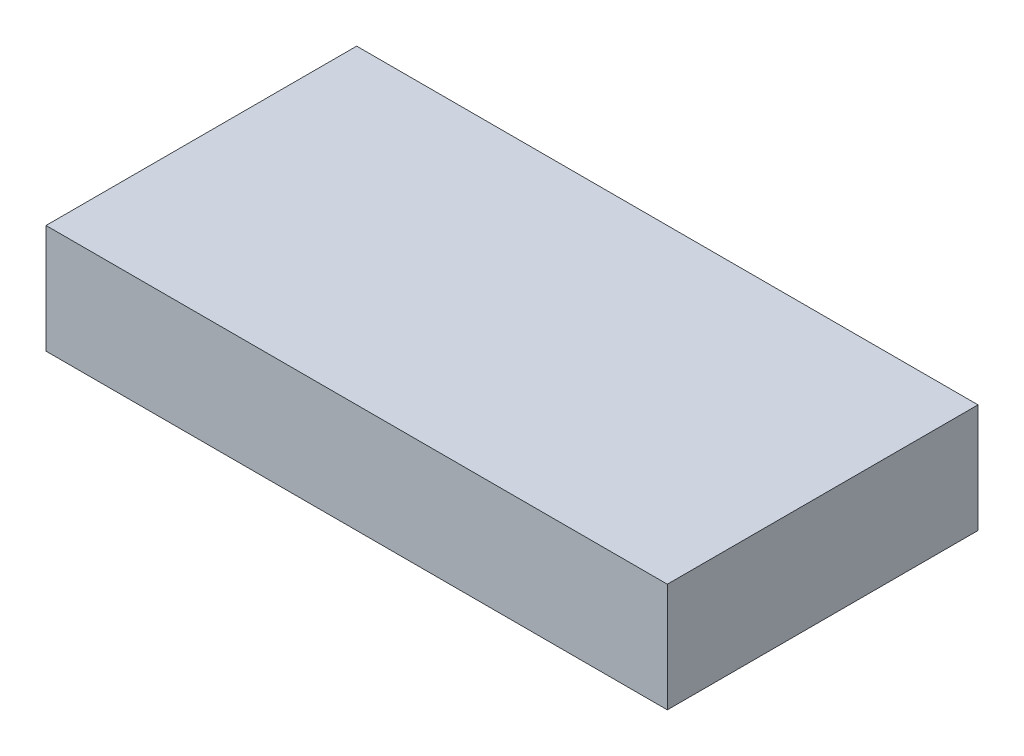
ISO-10303-21;
HEADER;
FILE_DESCRIPTION(('STEP AP214'),'2;1');
FILE_NAME('part.step','',(''),(''),'','','');
FILE_SCHEMA(('AUTOMOTIVE_DESIGN { 1 0 10303 214 1 1 1 1 }'));
ENDSEC;
DATA;
#1=APPLICATION_CONTEXT('core data for automotive mechanical design processes');
#2=APPLICATION_PROTOCOL_DEFINITION('international standard','automotive_design',2000,#1);
#3=PRODUCT_CONTEXT('',#1,'mechanical');
#4=PRODUCT('Part','Part','',(#3));
#5=PRODUCT_RELATED_PRODUCT_CATEGORY('part','',(#4));
#6=PRODUCT_DEFINITION_FORMATION('','',#4);
#7=PRODUCT_DEFINITION_CONTEXT('part definition',#1,'design');
#8=PRODUCT_DEFINITION('design','',#6,#7);
#9=PRODUCT_DEFINITION_SHAPE('','',#8);
#10=(LENGTH_UNIT() NAMED_UNIT(*) SI_UNIT(.MILLI.,.METRE.));
#11=(NAMED_UNIT(*) PLANE_ANGLE_UNIT() SI_UNIT($,.RADIAN.));
#12=(NAMED_UNIT(*) SI_UNIT($,.STERADIAN.) SOLID_ANGLE_UNIT());
#13=UNCERTAINTY_MEASURE_WITH_UNIT(LENGTH_MEASURE(1.E-05),#10,'distance_accuracy_value','');
#14=(GEOMETRIC_REPRESENTATION_CONTEXT(3) GLOBAL_UNCERTAINTY_ASSIGNED_CONTEXT((#13)) GLOBAL_UNIT_ASSIGNED_CONTEXT((#10,
#11,#12)) REPRESENTATION_CONTEXT('',''));
#15=CARTESIAN_POINT('',(0.,0.,0.));
#16=DIRECTION('',(0.,0.,1.));
#17=DIRECTION('',(1.,0.,0.));
#18=AXIS2_PLACEMENT_3D('',#15,#16,#17);
#19=CARTESIAN_POINT('',(0.,1.6425,0.));
#20=DIRECTION('',(0.,1.,0.));
#21=DIRECTION('',(0.,0.,1.));
#22=AXIS2_PLACEMENT_3D('',#19,#20,#21);
#23=PLANE('',#22);
#24=DIRECTION('',(0.,0.,-1.));
#25=VECTOR('',#24,1.);
#26=CARTESIAN_POINT('',(6.4225,1.6425,2.39));
#27=LINE('',#26,#25);
#28=CARTESIAN_POINT('',(6.4225,1.6425,-2.39));
#29=VERTEX_POINT('',#28);
#30=CARTESIAN_POINT('',(6.4225,1.6425,2.39));
#31=VERTEX_POINT('',#30);
#32=EDGE_CURVE('E122',#29,#31,#27,.F.);
#33=ORIENTED_EDGE('',*,*,#32,.T.);
#34=DIRECTION('',(1.,0.,0.));
#35=VECTOR('',#34,1.);
#36=CARTESIAN_POINT('',(-6.4225,1.6425,2.39));
#37=LINE('',#36,#35);
#38=CARTESIAN_POINT('',(-6.4225,1.6425,2.39));
#39=VERTEX_POINT('',#38);
#40=EDGE_CURVE('E107',#31,#39,#37,.F.);
#41=ORIENTED_EDGE('',*,*,#40,.T.);
#42=DIRECTION('',(0.,0.,1.));
#43=VECTOR('',#42,1.);
#44=CARTESIAN_POINT('',(-6.4225,1.6425,-2.39));
#45=LINE('',#44,#43);
#46=CARTESIAN_POINT('',(-6.4225,1.6425,-2.39));
#47=VERTEX_POINT('',#46);
#48=EDGE_CURVE('E19',#39,#47,#45,.F.);
#49=ORIENTED_EDGE('',*,*,#48,.T.);
#50=DIRECTION('',(-1.,0.,0.));
#51=VECTOR('',#50,1.);
#52=CARTESIAN_POINT('',(6.4225,1.6425,-2.39));
#53=LINE('',#52,#51);
#54=EDGE_CURVE('E102',#47,#29,#53,.F.);
#55=ORIENTED_EDGE('',*,*,#54,.T.);
#56=EDGE_LOOP('',(#33,#41,#49,#55));
#57=FACE_BOUND('',#56,.T.);
#58=ADVANCED_FACE('F16',(#57),#23,.F.);
#59=CARTESIAN_POINT('',(-6.4225,0.,-2.39));
#60=DIRECTION('',(-1.,0.,0.));
#61=DIRECTION('',(0.,0.,1.));
#62=AXIS2_PLACEMENT_3D('',#59,#60,#61);
#63=PLANE('',#62);
#64=ORIENTED_EDGE('',*,*,#48,.F.);
#65=DIRECTION('',(0.,1.,0.));
#66=VECTOR('',#65,1.);
#67=CARTESIAN_POINT('',(-6.4225,0.,2.39));
#68=LINE('',#67,#66);
#69=CARTESIAN_POINT('',(-6.4225,0.,2.39));
#70=VERTEX_POINT('',#69);
#71=EDGE_CURVE('E130',#39,#70,#68,.F.);
#72=ORIENTED_EDGE('',*,*,#71,.T.);
#73=DIRECTION('',(0.,0.,1.));
#74=VECTOR('',#73,1.);
#75=CARTESIAN_POINT('',(-6.4225,0.,0.));
#76=LINE('',#75,#74);
#77=CARTESIAN_POINT('',(-6.4225,0.,-2.39));
#78=VERTEX_POINT('',#77);
#79=EDGE_CURVE('E114',#70,#78,#76,.F.);
#80=ORIENTED_EDGE('',*,*,#79,.T.);
#81=DIRECTION('',(0.,1.,0.));
#82=VECTOR('',#81,1.);
#83=CARTESIAN_POINT('',(-6.4225,0.,-2.39));
#84=LINE('',#83,#82);
#85=EDGE_CURVE('E110',#78,#47,#84,.T.);
#86=ORIENTED_EDGE('',*,*,#85,.T.);
#87=EDGE_LOOP('',(#64,#72,#80,#86));
#88=FACE_BOUND('',#87,.T.);
#89=ADVANCED_FACE('F112',(#88),#63,.F.);
#90=CARTESIAN_POINT('',(6.4225,0.,-2.39));
#91=DIRECTION('',(0.,0.,-1.));
#92=DIRECTION('',(-1.,0.,0.));
#93=AXIS2_PLACEMENT_3D('',#90,#91,#92);
#94=PLANE('',#93);
#95=ORIENTED_EDGE('',*,*,#54,.F.);
#96=ORIENTED_EDGE('',*,*,#85,.F.);
#97=DIRECTION('',(1.,0.,0.));
#98=VECTOR('',#97,1.);
#99=CARTESIAN_POINT('',(0.,0.,-2.39));
#100=LINE('',#99,#98);
#101=CARTESIAN_POINT('',(6.4225,0.,-2.39));
#102=VERTEX_POINT('',#101);
#103=EDGE_CURVE('E133',#78,#102,#100,.T.);
#104=ORIENTED_EDGE('',*,*,#103,.T.);
#105=DIRECTION('',(0.,1.,0.));
#106=VECTOR('',#105,1.);
#107=CARTESIAN_POINT('',(6.4225,0.,-2.39));
#108=LINE('',#107,#106);
#109=EDGE_CURVE('E119',#102,#29,#108,.T.);
#110=ORIENTED_EDGE('',*,*,#109,.T.);
#111=EDGE_LOOP('',(#95,#96,#104,#110));
#112=FACE_BOUND('',#111,.T.);
#113=ADVANCED_FACE('F117',(#112),#94,.F.);
#114=CARTESIAN_POINT('',(6.4225,0.,2.39));
#115=DIRECTION('',(1.,0.,0.));
#116=DIRECTION('',(0.,0.,-1.));
#117=AXIS2_PLACEMENT_3D('',#114,#115,#116);
#118=PLANE('',#117);
#119=ORIENTED_EDGE('',*,*,#32,.F.);
#120=ORIENTED_EDGE('',*,*,#109,.F.);
#121=DIRECTION('',(0.,0.,1.));
#122=VECTOR('',#121,1.);
#123=CARTESIAN_POINT('',(6.4225,0.,0.));
#124=LINE('',#123,#122);
#125=CARTESIAN_POINT('',(6.4225,0.,2.39));
#126=VERTEX_POINT('',#125);
#127=EDGE_CURVE('E135',#102,#126,#124,.T.);
#128=ORIENTED_EDGE('',*,*,#127,.T.);
#129=DIRECTION('',(0.,1.,0.));
#130=VECTOR('',#129,1.);
#131=CARTESIAN_POINT('',(6.4225,0.,2.39));
#132=LINE('',#131,#130);
#133=EDGE_CURVE('E126',#126,#31,#132,.T.);
#134=ORIENTED_EDGE('',*,*,#133,.T.);
#135=EDGE_LOOP('',(#119,#120,#128,#134));
#136=FACE_BOUND('',#135,.T.);
#137=ADVANCED_FACE('F322',(#136),#118,.F.);
#138=CARTESIAN_POINT('',(-6.4225,0.,2.39));
#139=DIRECTION('',(0.,0.,1.));
#140=DIRECTION('',(1.,0.,0.));
#141=AXIS2_PLACEMENT_3D('',#138,#139,#140);
#142=PLANE('',#141);
#143=ORIENTED_EDGE('',*,*,#40,.F.);
#144=ORIENTED_EDGE('',*,*,#133,.F.);
#145=DIRECTION('',(1.,0.,0.));
#146=VECTOR('',#145,1.);
#147=CARTESIAN_POINT('',(0.,0.,2.39));
#148=LINE('',#147,#146);
#149=EDGE_CURVE('E137',#126,#70,#148,.F.);
#150=ORIENTED_EDGE('',*,*,#149,.T.);
#151=ORIENTED_EDGE('',*,*,#71,.F.);
#152=EDGE_LOOP('',(#143,#144,#150,#151));
#153=FACE_BOUND('',#152,.T.);
#154=ADVANCED_FACE('F313',(#153),#142,.F.);
#155=CARTESIAN_POINT('',(0.,0.,0.));
#156=DIRECTION('',(0.,1.,0.));
#157=DIRECTION('',(0.,0.,1.));
#158=AXIS2_PLACEMENT_3D('',#155,#156,#157);
#159=PLANE('',#158);
#160=ORIENTED_EDGE('',*,*,#127,.F.);
#161=ORIENTED_EDGE('',*,*,#103,.F.);
#162=ORIENTED_EDGE('',*,*,#79,.F.);
#163=ORIENTED_EDGE('',*,*,#149,.F.);
#164=EDGE_LOOP('',(#160,#161,#162,#163));
#165=FACE_BOUND('',#164,.T.);
#166=DIRECTION('',(-1.,0.,0.));
#167=VECTOR('',#166,1.);
#168=CARTESIAN_POINT('',(7.6575,0.,3.625));
#169=LINE('',#168,#167);
#170=CARTESIAN_POINT('',(7.6575,0.,3.625));
#171=VERTEX_POINT('',#170);
#172=CARTESIAN_POINT('',(-7.6575,0.,3.625));
#173=VERTEX_POINT('',#172);
#174=EDGE_CURVE('E147',#171,#173,#169,.T.);
#175=ORIENTED_EDGE('',*,*,#174,.T.);
#176=DIRECTION('',(0.,0.,-1.));
#177=VECTOR('',#176,1.);
#178=CARTESIAN_POINT('',(-7.6575,0.,3.625));
#179=LINE('',#178,#177);
#180=CARTESIAN_POINT('',(-7.6575,0.,-3.625));
#181=VERTEX_POINT('',#180);
#182=EDGE_CURVE('E152',#173,#181,#179,.T.);
#183=ORIENTED_EDGE('',*,*,#182,.T.);
#184=DIRECTION('',(1.,0.,0.));
#185=VECTOR('',#184,1.);
#186=CARTESIAN_POINT('',(-7.6575,0.,-3.625));
#187=LINE('',#186,#185);
#188=CARTESIAN_POINT('',(7.6575,0.,-3.625));
#189=VERTEX_POINT('',#188);
#190=EDGE_CURVE('E140',#181,#189,#187,.T.);
#191=ORIENTED_EDGE('',*,*,#190,.T.);
#192=DIRECTION('',(0.,0.,1.));
#193=VECTOR('',#192,1.);
#194=CARTESIAN_POINT('',(7.6575,0.,-3.625));
#195=LINE('',#194,#193);
#196=EDGE_CURVE('E142',#189,#171,#195,.T.);
#197=ORIENTED_EDGE('',*,*,#196,.T.);
#198=EDGE_LOOP('',(#175,#183,#191,#197));
#199=FACE_BOUND('',#198,.T.);
#200=ADVANCED_FACE('F304',(#165,#199),#159,.F.);
#201=CARTESIAN_POINT('',(-7.6575,0.,-3.625));
#202=DIRECTION('',(0.,0.,1.));
#203=DIRECTION('',(1.,0.,0.));
#204=AXIS2_PLACEMENT_3D('',#201,#202,#203);
#205=PLANE('',#204);
#206=DIRECTION('',(1.,0.,0.));
#207=VECTOR('',#206,1.);
#208=CARTESIAN_POINT('',(0.,0.4,-3.625));
#209=LINE('',#208,#207);
#210=CARTESIAN_POINT('',(-7.6575,0.4,-3.625));
#211=VERTEX_POINT('',#210);
#212=CARTESIAN_POINT('',(7.6575,0.4,-3.625));
#213=VERTEX_POINT('',#212);
#214=EDGE_CURVE('E159',#211,#213,#209,.T.);
#215=ORIENTED_EDGE('',*,*,#214,.T.);
#216=DIRECTION('',(0.,1.,0.));
#217=VECTOR('',#216,1.);
#218=CARTESIAN_POINT('',(7.6575,0.,-3.625));
#219=LINE('',#218,#217);
#220=EDGE_CURVE('E144',#213,#189,#219,.F.);
#221=ORIENTED_EDGE('',*,*,#220,.T.);
#222=ORIENTED_EDGE('',*,*,#190,.F.);
#223=DIRECTION('',(0.,1.,0.));
#224=VECTOR('',#223,1.);
#225=CARTESIAN_POINT('',(-7.6575,0.,-3.625));
#226=LINE('',#225,#224);
#227=EDGE_CURVE('E154',#181,#211,#226,.T.);
#228=ORIENTED_EDGE('',*,*,#227,.T.);
#229=EDGE_LOOP('',(#215,#221,#222,#228));
#230=FACE_BOUND('',#229,.T.);
#231=ADVANCED_FACE('F295',(#230),#205,.F.);
#232=CARTESIAN_POINT('',(7.6575,0.,-3.625));
#233=DIRECTION('',(-1.,0.,0.));
#234=DIRECTION('',(0.,0.,1.));
#235=AXIS2_PLACEMENT_3D('',#232,#233,#234);
#236=PLANE('',#235);
#237=DIRECTION('',(0.,0.,1.));
#238=VECTOR('',#237,1.);
#239=CARTESIAN_POINT('',(7.6575,0.4,0.));
#240=LINE('',#239,#238);
#241=CARTESIAN_POINT('',(7.6575,0.4,3.625));
#242=VERTEX_POINT('',#241);
#243=EDGE_CURVE('E161',#213,#242,#240,.T.);
#244=ORIENTED_EDGE('',*,*,#243,.T.);
#245=DIRECTION('',(0.,1.,0.));
#246=VECTOR('',#245,1.);
#247=CARTESIAN_POINT('',(7.6575,0.,3.625));
#248=LINE('',#247,#246);
#249=EDGE_CURVE('E149',#242,#171,#248,.F.);
#250=ORIENTED_EDGE('',*,*,#249,.T.);
#251=ORIENTED_EDGE('',*,*,#196,.F.);
#252=ORIENTED_EDGE('',*,*,#220,.F.);
#253=EDGE_LOOP('',(#244,#250,#251,#252));
#254=FACE_BOUND('',#253,.T.);
#255=ADVANCED_FACE('F286',(#254),#236,.F.);
#256=CARTESIAN_POINT('',(7.6575,0.,3.625));
#257=DIRECTION('',(0.,0.,-1.));
#258=DIRECTION('',(-1.,0.,0.));
#259=AXIS2_PLACEMENT_3D('',#256,#257,#258);
#260=PLANE('',#259);
#261=DIRECTION('',(1.,0.,0.));
#262=VECTOR('',#261,1.);
#263=CARTESIAN_POINT('',(0.,0.4,3.625));
#264=LINE('',#263,#262);
#265=CARTESIAN_POINT('',(-7.6575,0.4,3.625));
#266=VERTEX_POINT('',#265);
#267=EDGE_CURVE('E163',#242,#266,#264,.F.);
#268=ORIENTED_EDGE('',*,*,#267,.T.);
#269=DIRECTION('',(0.,1.,0.));
#270=VECTOR('',#269,1.);
#271=CARTESIAN_POINT('',(-7.6575,0.,3.625));
#272=LINE('',#271,#270);
#273=EDGE_CURVE('E156',#266,#173,#272,.F.);
#274=ORIENTED_EDGE('',*,*,#273,.T.);
#275=ORIENTED_EDGE('',*,*,#174,.F.);
#276=ORIENTED_EDGE('',*,*,#249,.F.);
#277=EDGE_LOOP('',(#268,#274,#275,#276));
#278=FACE_BOUND('',#277,.T.);
#279=ADVANCED_FACE('F277',(#278),#260,.F.);
#280=CARTESIAN_POINT('',(-7.6575,0.,3.625));
#281=DIRECTION('',(1.,0.,0.));
#282=DIRECTION('',(0.,0.,-1.));
#283=AXIS2_PLACEMENT_3D('',#280,#281,#282);
#284=PLANE('',#283);
#285=DIRECTION('',(0.,0.,1.));
#286=VECTOR('',#285,1.);
#287=CARTESIAN_POINT('',(-7.6575,0.4,0.));
#288=LINE('',#287,#286);
#289=EDGE_CURVE('E165',#266,#211,#288,.F.);
#290=ORIENTED_EDGE('',*,*,#289,.T.);
#291=ORIENTED_EDGE('',*,*,#227,.F.);
#292=ORIENTED_EDGE('',*,*,#182,.F.);
#293=ORIENTED_EDGE('',*,*,#273,.F.);
#294=EDGE_LOOP('',(#290,#291,#292,#293));
#295=FACE_BOUND('',#294,.T.);
#296=ADVANCED_FACE('F218',(#295),#284,.F.);
#297=CARTESIAN_POINT('',(0.,0.4,0.));
#298=DIRECTION('',(0.,1.,0.));
#299=DIRECTION('',(0.,0.,1.));
#300=AXIS2_PLACEMENT_3D('',#297,#298,#299);
#301=PLANE('',#300);
#302=ORIENTED_EDGE('',*,*,#267,.F.);
#303=ORIENTED_EDGE('',*,*,#243,.F.);
#304=ORIENTED_EDGE('',*,*,#214,.F.);
#305=ORIENTED_EDGE('',*,*,#289,.F.);
#306=EDGE_LOOP('',(#302,#303,#304,#305));
#307=FACE_BOUND('',#306,.T.);
#308=DIRECTION('',(0.,0.,-1.));
#309=VECTOR('',#308,1.);
#310=CARTESIAN_POINT('',(8.065,0.4,4.0325));
#311=LINE('',#310,#309);
#312=CARTESIAN_POINT('',(8.065,0.4,4.0325));
#313=VERTEX_POINT('',#312);
#314=CARTESIAN_POINT('',(8.065,0.4,-4.0325));
#315=VERTEX_POINT('',#314);
#316=EDGE_CURVE('E173',#313,#315,#311,.T.);
#317=ORIENTED_EDGE('',*,*,#316,.F.);
#318=DIRECTION('',(1.,0.,0.));
#319=VECTOR('',#318,1.);
#320=CARTESIAN_POINT('',(-8.065,0.4,4.0325));
#321=LINE('',#320,#319);
#322=CARTESIAN_POINT('',(-8.065,0.4,4.0325));
#323=VERTEX_POINT('',#322);
#324=EDGE_CURVE('E168',#323,#313,#321,.T.);
#325=ORIENTED_EDGE('',*,*,#324,.F.);
#326=DIRECTION('',(0.,0.,1.));
#327=VECTOR('',#326,1.);
#328=CARTESIAN_POINT('',(-8.065,0.4,-4.0325));
#329=LINE('',#328,#327);
#330=CARTESIAN_POINT('',(-8.065,0.4,-4.0325));
#331=VERTEX_POINT('',#330);
#332=EDGE_CURVE('E184',#331,#323,#329,.T.);
#333=ORIENTED_EDGE('',*,*,#332,.F.);
#334=DIRECTION('',(-1.,0.,0.));
#335=VECTOR('',#334,1.);
#336=CARTESIAN_POINT('',(8.065,0.4,-4.0325));
#337=LINE('',#336,#335);
#338=EDGE_CURVE('E178',#315,#331,#337,.T.);
#339=ORIENTED_EDGE('',*,*,#338,.F.);
#340=EDGE_LOOP('',(#317,#325,#333,#339));
#341=FACE_BOUND('',#340,.T.);
#342=ADVANCED_FACE('F204',(#307,#341),#301,.F.);
#343=CARTESIAN_POINT('',(-8.065,0.,4.0325));
#344=DIRECTION('',(0.,0.,1.));
#345=DIRECTION('',(1.,0.,0.));
#346=AXIS2_PLACEMENT_3D('',#343,#344,#345);
#347=PLANE('',#346);
#348=DIRECTION('',(0.,1.,0.));
#349=VECTOR('',#348,1.);
#350=CARTESIAN_POINT('',(-8.065,0.,4.0325));
#351=LINE('',#350,#349);
#352=CARTESIAN_POINT('',(-8.065,3.226,4.0325));
#353=VERTEX_POINT('',#352);
#354=EDGE_CURVE('E180',#323,#353,#351,.T.);
#355=ORIENTED_EDGE('',*,*,#354,.F.);
#356=ORIENTED_EDGE('',*,*,#324,.T.);
#357=DIRECTION('',(0.,1.,0.));
#358=VECTOR('',#357,1.);
#359=CARTESIAN_POINT('',(8.065,0.,4.0325));
#360=LINE('',#359,#358);
#361=CARTESIAN_POINT('',(8.065,3.226,4.0325));
#362=VERTEX_POINT('',#361);
#363=EDGE_CURVE('E170',#362,#313,#360,.F.);
#364=ORIENTED_EDGE('',*,*,#363,.F.);
#365=DIRECTION('',(1.,0.,0.));
#366=VECTOR('',#365,1.);
#367=CARTESIAN_POINT('',(0.,3.226,4.0325));
#368=LINE('',#367,#366);
#369=EDGE_CURVE('E187',#353,#362,#368,.T.);
#370=ORIENTED_EDGE('',*,*,#369,.F.);
#371=EDGE_LOOP('',(#355,#356,#364,#370));
#372=FACE_BOUND('',#371,.T.);
#373=ADVANCED_FACE('F209',(#372),#347,.T.);
#374=CARTESIAN_POINT('',(8.065,0.,4.0325));
#375=DIRECTION('',(1.,0.,0.));
#376=DIRECTION('',(0.,0.,-1.));
#377=AXIS2_PLACEMENT_3D('',#374,#375,#376);
#378=PLANE('',#377);
#379=ORIENTED_EDGE('',*,*,#363,.T.);
#380=ORIENTED_EDGE('',*,*,#316,.T.);
#381=DIRECTION('',(0.,1.,0.));
#382=VECTOR('',#381,1.);
#383=CARTESIAN_POINT('',(8.065,0.,-4.0325));
#384=LINE('',#383,#382);
#385=CARTESIAN_POINT('',(8.065,3.226,-4.0325));
#386=VERTEX_POINT('',#385);
#387=EDGE_CURVE('E175',#386,#315,#384,.F.);
#388=ORIENTED_EDGE('',*,*,#387,.F.);
#389=DIRECTION('',(0.,0.,1.));
#390=VECTOR('',#389,1.);
#391=CARTESIAN_POINT('',(8.065,3.226,0.));
#392=LINE('',#391,#390);
#393=EDGE_CURVE('E190',#362,#386,#392,.F.);
#394=ORIENTED_EDGE('',*,*,#393,.F.);
#395=EDGE_LOOP('',(#379,#380,#388,#394));
#396=FACE_BOUND('',#395,.T.);
#397=ADVANCED_FACE('F201',(#396),#378,.T.);
#398=CARTESIAN_POINT('',(8.065,0.,-4.0325));
#399=DIRECTION('',(0.,0.,-1.));
#400=DIRECTION('',(-1.,0.,0.));
#401=AXIS2_PLACEMENT_3D('',#398,#399,#400);
#402=PLANE('',#401);
#403=ORIENTED_EDGE('',*,*,#387,.T.);
#404=ORIENTED_EDGE('',*,*,#338,.T.);
#405=DIRECTION('',(0.,1.,0.));
#406=VECTOR('',#405,1.);
#407=CARTESIAN_POINT('',(-8.065,0.,-4.0325));
#408=LINE('',#407,#406);
#409=CARTESIAN_POINT('',(-8.065,3.226,-4.0325));
#410=VERTEX_POINT('',#409);
#411=EDGE_CURVE('E34',#410,#331,#408,.F.);
#412=ORIENTED_EDGE('',*,*,#411,.F.);
#413=DIRECTION('',(1.,0.,0.));
#414=VECTOR('',#413,1.);
#415=CARTESIAN_POINT('',(0.,3.226,-4.0325));
#416=LINE('',#415,#414);
#417=EDGE_CURVE('E25',#386,#410,#416,.F.);
#418=ORIENTED_EDGE('',*,*,#417,.F.);
#419=EDGE_LOOP('',(#403,#404,#412,#418));
#420=FACE_BOUND('',#419,.T.);
#421=ADVANCED_FACE('F197',(#420),#402,.T.);
#422=CARTESIAN_POINT('',(-8.065,0.,-4.0325));
#423=DIRECTION('',(-1.,0.,0.));
#424=DIRECTION('',(0.,0.,1.));
#425=AXIS2_PLACEMENT_3D('',#422,#423,#424);
#426=PLANE('',#425);
#427=ORIENTED_EDGE('',*,*,#411,.T.);
#428=ORIENTED_EDGE('',*,*,#332,.T.);
#429=ORIENTED_EDGE('',*,*,#354,.T.);
#430=DIRECTION('',(0.,0.,1.));
#431=VECTOR('',#430,1.);
#432=CARTESIAN_POINT('',(-8.065,3.226,0.));
#433=LINE('',#432,#431);
#434=EDGE_CURVE('E10',#410,#353,#433,.T.);
#435=ORIENTED_EDGE('',*,*,#434,.F.);
#436=EDGE_LOOP('',(#427,#428,#429,#435));
#437=FACE_BOUND('',#436,.T.);
#438=ADVANCED_FACE('F207',(#437),#426,.T.);
#439=CARTESIAN_POINT('',(0.,3.226,0.));
#440=DIRECTION('',(0.,1.,0.));
#441=DIRECTION('',(0.,0.,1.));
#442=AXIS2_PLACEMENT_3D('',#439,#440,#441);
#443=PLANE('',#442);
#444=ORIENTED_EDGE('',*,*,#417,.T.);
#445=ORIENTED_EDGE('',*,*,#434,.T.);
#446=ORIENTED_EDGE('',*,*,#369,.T.);
#447=ORIENTED_EDGE('',*,*,#393,.T.);
#448=EDGE_LOOP('',(#444,#445,#446,#447));
#449=FACE_BOUND('',#448,.T.);
#450=ADVANCED_FACE('F195',(#449),#443,.T.);
#451=CLOSED_SHELL('',(#58,#89,#113,#137,#154,#200,#231,#255,#279,#296,#342,#373,#397,#421,#438,#450));
#452=MANIFOLD_SOLID_BREP('B1',#451);
#453=ADVANCED_BREP_SHAPE_REPRESENTATION('',(#18,#452),#14);
#454=SHAPE_DEFINITION_REPRESENTATION(#9,#453);
ENDSEC;
END-ISO-10303-21;
